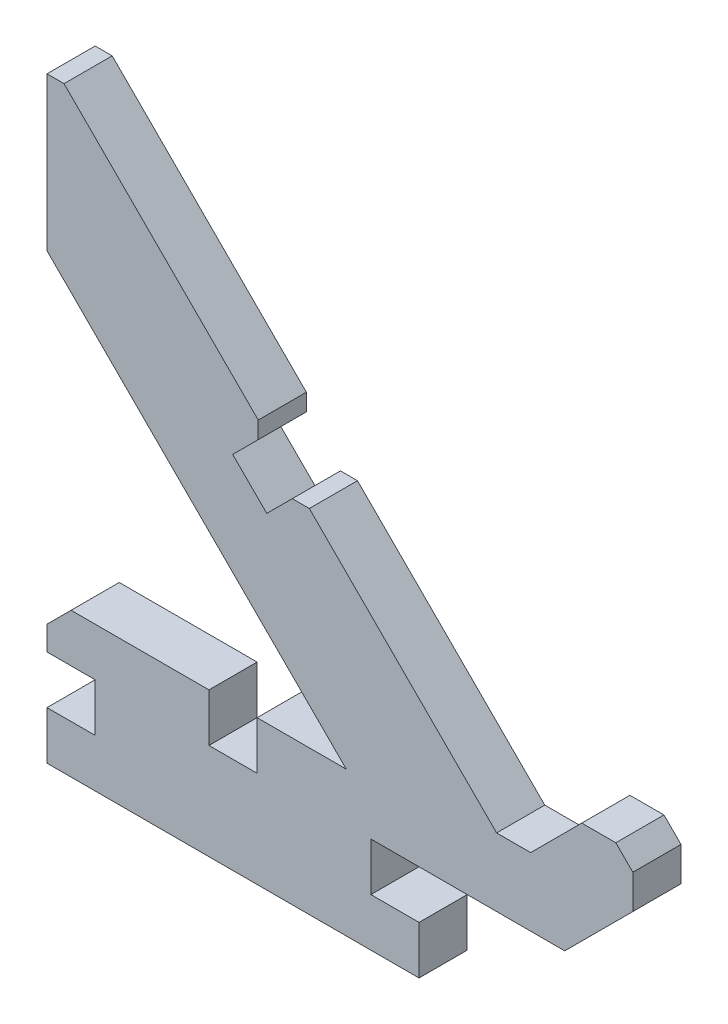
ISO-10303-21;
HEADER;
FILE_DESCRIPTION(('STEP AP214'),'2;1');
FILE_NAME('part.step','',(''),(''),'','','');
FILE_SCHEMA(('AUTOMOTIVE_DESIGN { 1 0 10303 214 1 1 1 1 }'));
ENDSEC;
DATA;
#1=APPLICATION_CONTEXT('core data for automotive mechanical design processes');
#2=APPLICATION_PROTOCOL_DEFINITION('international standard','automotive_design',2000,#1);
#3=PRODUCT_CONTEXT('',#1,'mechanical');
#4=PRODUCT('Part','Part','',(#3));
#5=PRODUCT_RELATED_PRODUCT_CATEGORY('part','',(#4));
#6=PRODUCT_DEFINITION_FORMATION('','',#4);
#7=PRODUCT_DEFINITION_CONTEXT('part definition',#1,'design');
#8=PRODUCT_DEFINITION('design','',#6,#7);
#9=PRODUCT_DEFINITION_SHAPE('','',#8);
#10=(LENGTH_UNIT() NAMED_UNIT(*) SI_UNIT(.MILLI.,.METRE.));
#11=(NAMED_UNIT(*) PLANE_ANGLE_UNIT() SI_UNIT($,.RADIAN.));
#12=(NAMED_UNIT(*) SI_UNIT($,.STERADIAN.) SOLID_ANGLE_UNIT());
#13=UNCERTAINTY_MEASURE_WITH_UNIT(LENGTH_MEASURE(1.E-05),#10,'distance_accuracy_value','');
#14=(GEOMETRIC_REPRESENTATION_CONTEXT(3) GLOBAL_UNCERTAINTY_ASSIGNED_CONTEXT((#13)) GLOBAL_UNIT_ASSIGNED_CONTEXT((#10,
#11,#12)) REPRESENTATION_CONTEXT('',''));
#15=CARTESIAN_POINT('',(0.,0.,0.));
#16=DIRECTION('',(0.,0.,1.));
#17=DIRECTION('',(1.,0.,0.));
#18=AXIS2_PLACEMENT_3D('',#15,#16,#17);
#19=CARTESIAN_POINT('',(0.,12.,4.));
#20=DIRECTION('',(0.,-1.,0.));
#21=DIRECTION('',(1.,0.,0.));
#22=AXIS2_PLACEMENT_3D('',#19,#20,#21);
#23=PLANE('',#22);
#24=DIRECTION('',(-1.,0.,0.));
#25=VECTOR('',#24,1.);
#26=CARTESIAN_POINT('',(0.,12.,0.));
#27=LINE('',#26,#25);
#28=CARTESIAN_POINT('',(24.8578643762687,12.,0.));
#29=VERTEX_POINT('',#28);
#30=CARTESIAN_POINT('',(17.45,12.,0.));
#31=VERTEX_POINT('',#30);
#32=EDGE_CURVE('E287',#29,#31,#27,.T.);
#33=ORIENTED_EDGE('',*,*,#32,.T.);
#34=DIRECTION('',(0.,0.,-1.));
#35=VECTOR('',#34,1.);
#36=CARTESIAN_POINT('',(17.45,12.,4.));
#37=LINE('',#36,#35);
#38=CARTESIAN_POINT('',(17.45,12.,4.));
#39=VERTEX_POINT('',#38);
#40=EDGE_CURVE('E264',#39,#31,#37,.T.);
#41=ORIENTED_EDGE('',*,*,#40,.F.);
#42=DIRECTION('',(-1.,0.,0.));
#43=VECTOR('',#42,1.);
#44=CARTESIAN_POINT('',(0.,12.,4.));
#45=LINE('',#44,#43);
#46=CARTESIAN_POINT('',(24.8578643762687,12.,4.));
#47=VERTEX_POINT('',#46);
#48=EDGE_CURVE('E271',#47,#39,#45,.T.);
#49=ORIENTED_EDGE('',*,*,#48,.F.);
#50=DIRECTION('',(0.,0.,-1.));
#51=VECTOR('',#50,1.);
#52=CARTESIAN_POINT('',(24.8578643762687,12.,4.));
#53=LINE('',#52,#51);
#54=EDGE_CURVE('E416',#47,#29,#53,.T.);
#55=ORIENTED_EDGE('',*,*,#54,.T.);
#56=EDGE_LOOP('',(#33,#41,#49,#55));
#57=FACE_BOUND('',#56,.T.);
#58=ADVANCED_FACE('F48',(#57),#23,.F.);
#59=CARTESIAN_POINT('',(17.45,0.,4.));
#60=DIRECTION('',(1.,0.,0.));
#61=DIRECTION('',(0.,0.,-1.));
#62=AXIS2_PLACEMENT_3D('',#59,#60,#61);
#63=PLANE('',#62);
#64=DIRECTION('',(0.,-1.,0.));
#65=VECTOR('',#64,1.);
#66=CARTESIAN_POINT('',(17.45,0.,0.));
#67=LINE('',#66,#65);
#68=CARTESIAN_POINT('',(17.45,8.,0.));
#69=VERTEX_POINT('',#68);
#70=EDGE_CURVE('E478',#31,#69,#67,.T.);
#71=ORIENTED_EDGE('',*,*,#70,.T.);
#72=DIRECTION('',(0.,0.,-1.));
#73=VECTOR('',#72,1.);
#74=CARTESIAN_POINT('',(17.45,8.,4.));
#75=LINE('',#74,#73);
#76=CARTESIAN_POINT('',(17.45,8.,4.));
#77=VERTEX_POINT('',#76);
#78=EDGE_CURVE('E266',#77,#69,#75,.T.);
#79=ORIENTED_EDGE('',*,*,#78,.F.);
#80=DIRECTION('',(0.,-1.,0.));
#81=VECTOR('',#80,1.);
#82=CARTESIAN_POINT('',(17.45,0.,4.));
#83=LINE('',#82,#81);
#84=EDGE_CURVE('E259',#39,#77,#83,.T.);
#85=ORIENTED_EDGE('',*,*,#84,.F.);
#86=ORIENTED_EDGE('',*,*,#40,.T.);
#87=EDGE_LOOP('',(#71,#79,#85,#86));
#88=FACE_BOUND('',#87,.T.);
#89=ADVANCED_FACE('F262',(#88),#63,.F.);
#90=CARTESIAN_POINT('',(0.,8.,4.));
#91=DIRECTION('',(0.,1.,0.));
#92=DIRECTION('',(0.,0.,1.));
#93=AXIS2_PLACEMENT_3D('',#90,#91,#92);
#94=PLANE('',#93);
#95=DIRECTION('',(1.,0.,0.));
#96=VECTOR('',#95,1.);
#97=CARTESIAN_POINT('',(0.,8.,0.));
#98=LINE('',#97,#96);
#99=CARTESIAN_POINT('',(13.45,8.,0.));
#100=VERTEX_POINT('',#99);
#101=EDGE_CURVE('E475',#100,#69,#98,.T.);
#102=ORIENTED_EDGE('',*,*,#101,.F.);
#103=DIRECTION('',(0.,0.,-1.));
#104=VECTOR('',#103,1.);
#105=CARTESIAN_POINT('',(13.45,8.,4.));
#106=LINE('',#105,#104);
#107=CARTESIAN_POINT('',(13.45,8.,4.));
#108=VERTEX_POINT('',#107);
#109=EDGE_CURVE('E298',#108,#100,#106,.T.);
#110=ORIENTED_EDGE('',*,*,#109,.F.);
#111=DIRECTION('',(1.,0.,0.));
#112=VECTOR('',#111,1.);
#113=CARTESIAN_POINT('',(0.,8.,4.));
#114=LINE('',#113,#112);
#115=EDGE_CURVE('E270',#108,#77,#114,.T.);
#116=ORIENTED_EDGE('',*,*,#115,.T.);
#117=ORIENTED_EDGE('',*,*,#78,.T.);
#118=EDGE_LOOP('',(#102,#110,#116,#117));
#119=FACE_BOUND('',#118,.T.);
#120=ADVANCED_FACE('F476',(#119),#94,.T.);
#121=CARTESIAN_POINT('',(13.45,0.,4.));
#122=DIRECTION('',(1.,0.,0.));
#123=DIRECTION('',(0.,0.,-1.));
#124=AXIS2_PLACEMENT_3D('',#121,#122,#123);
#125=PLANE('',#124);
#126=DIRECTION('',(0.,-1.,0.));
#127=VECTOR('',#126,1.);
#128=CARTESIAN_POINT('',(13.45,0.,0.));
#129=LINE('',#128,#127);
#130=CARTESIAN_POINT('',(13.45,12.,0.));
#131=VERTEX_POINT('',#130);
#132=EDGE_CURVE('E470',#131,#100,#129,.T.);
#133=ORIENTED_EDGE('',*,*,#132,.F.);
#134=DIRECTION('',(0.,0.,-1.));
#135=VECTOR('',#134,1.);
#136=CARTESIAN_POINT('',(13.45,12.,4.));
#137=LINE('',#136,#135);
#138=CARTESIAN_POINT('',(13.45,12.,4.));
#139=VERTEX_POINT('',#138);
#140=EDGE_CURVE('E459',#139,#131,#137,.T.);
#141=ORIENTED_EDGE('',*,*,#140,.F.);
#142=DIRECTION('',(0.,-1.,0.));
#143=VECTOR('',#142,1.);
#144=CARTESIAN_POINT('',(13.45,0.,4.));
#145=LINE('',#144,#143);
#146=EDGE_CURVE('E472',#139,#108,#145,.T.);
#147=ORIENTED_EDGE('',*,*,#146,.T.);
#148=ORIENTED_EDGE('',*,*,#109,.T.);
#149=EDGE_LOOP('',(#133,#141,#147,#148));
#150=FACE_BOUND('',#149,.T.);
#151=ADVANCED_FACE('F468',(#150),#125,.T.);
#152=CARTESIAN_POINT('',(2.00000000000001,12.,0.));
#153=VERTEX_POINT('',#152);
#154=EDGE_CURVE('E482',#131,#153,#27,.T.);
#155=ORIENTED_EDGE('',*,*,#154,.T.);
#156=DIRECTION('',(0.,0.,1.));
#157=VECTOR('',#156,1.);
#158=CARTESIAN_POINT('',(2.00000000000001,12.,4.));
#159=LINE('',#158,#157);
#160=CARTESIAN_POINT('',(2.00000000000001,12.,4.));
#161=VERTEX_POINT('',#160);
#162=EDGE_CURVE('E346',#153,#161,#159,.T.);
#163=ORIENTED_EDGE('',*,*,#162,.T.);
#164=EDGE_CURVE('E285',#139,#161,#45,.T.);
#165=ORIENTED_EDGE('',*,*,#164,.F.);
#166=ORIENTED_EDGE('',*,*,#140,.T.);
#167=EDGE_LOOP('',(#155,#163,#165,#166));
#168=FACE_BOUND('',#167,.T.);
#169=ADVANCED_FACE('F860',(#168),#23,.F.);
#170=CARTESIAN_POINT('',(0.,0.,4.));
#171=DIRECTION('',(-1.,0.,0.));
#172=DIRECTION('',(0.,0.,1.));
#173=AXIS2_PLACEMENT_3D('',#170,#171,#172);
#174=PLANE('',#173);
#175=DIRECTION('',(0.,1.,0.));
#176=VECTOR('',#175,1.);
#177=CARTESIAN_POINT('',(0.,0.,4.));
#178=LINE('',#177,#176);
#179=CARTESIAN_POINT('',(0.,8.,4.));
#180=VERTEX_POINT('',#179);
#181=CARTESIAN_POINT('',(0.,10.,4.));
#182=VERTEX_POINT('',#181);
#183=EDGE_CURVE('E608',#180,#182,#178,.T.);
#184=ORIENTED_EDGE('',*,*,#183,.T.);
#185=DIRECTION('',(0.,0.,-1.));
#186=VECTOR('',#185,1.);
#187=CARTESIAN_POINT('',(0.,10.,0.));
#188=LINE('',#187,#186);
#189=CARTESIAN_POINT('',(0.,10.,0.));
#190=VERTEX_POINT('',#189);
#191=EDGE_CURVE('E342',#182,#190,#188,.T.);
#192=ORIENTED_EDGE('',*,*,#191,.T.);
#193=DIRECTION('',(0.,1.,0.));
#194=VECTOR('',#193,1.);
#195=CARTESIAN_POINT('',(0.,0.,0.));
#196=LINE('',#195,#194);
#197=CARTESIAN_POINT('',(0.,8.,0.));
#198=VERTEX_POINT('',#197);
#199=EDGE_CURVE('E488',#198,#190,#196,.T.);
#200=ORIENTED_EDGE('',*,*,#199,.F.);
#201=DIRECTION('',(0.,0.,-1.));
#202=VECTOR('',#201,1.);
#203=CARTESIAN_POINT('',(0.,8.,4.));
#204=LINE('',#203,#202);
#205=EDGE_CURVE('E456',#180,#198,#204,.T.);
#206=ORIENTED_EDGE('',*,*,#205,.F.);
#207=EDGE_LOOP('',(#184,#192,#200,#206));
#208=FACE_BOUND('',#207,.T.);
#209=ADVANCED_FACE('F868',(#208),#174,.T.);
#210=CARTESIAN_POINT('',(0.,8.,4.));
#211=DIRECTION('',(0.,-1.,0.));
#212=DIRECTION('',(0.,0.,-1.));
#213=AXIS2_PLACEMENT_3D('',#210,#211,#212);
#214=PLANE('',#213);
#215=DIRECTION('',(-1.,0.,0.));
#216=VECTOR('',#215,1.);
#217=CARTESIAN_POINT('',(0.,8.,0.));
#218=LINE('',#217,#216);
#219=CARTESIAN_POINT('',(4.,8.,0.));
#220=VERTEX_POINT('',#219);
#221=EDGE_CURVE('E495',#220,#198,#218,.T.);
#222=ORIENTED_EDGE('',*,*,#221,.F.);
#223=DIRECTION('',(0.,0.,-1.));
#224=VECTOR('',#223,1.);
#225=CARTESIAN_POINT('',(4.,8.,4.));
#226=LINE('',#225,#224);
#227=CARTESIAN_POINT('',(4.,8.,4.));
#228=VERTEX_POINT('',#227);
#229=EDGE_CURVE('E453',#228,#220,#226,.T.);
#230=ORIENTED_EDGE('',*,*,#229,.F.);
#231=DIRECTION('',(-1.,0.,0.));
#232=VECTOR('',#231,1.);
#233=CARTESIAN_POINT('',(0.,8.,4.));
#234=LINE('',#233,#232);
#235=EDGE_CURVE('E616',#228,#180,#234,.T.);
#236=ORIENTED_EDGE('',*,*,#235,.T.);
#237=ORIENTED_EDGE('',*,*,#205,.T.);
#238=EDGE_LOOP('',(#222,#230,#236,#237));
#239=FACE_BOUND('',#238,.T.);
#240=ADVANCED_FACE('F874',(#239),#214,.T.);
#241=CARTESIAN_POINT('',(4.,0.,4.));
#242=DIRECTION('',(-1.,0.,0.));
#243=DIRECTION('',(0.,0.,1.));
#244=AXIS2_PLACEMENT_3D('',#241,#242,#243);
#245=PLANE('',#244);
#246=DIRECTION('',(0.,1.,0.));
#247=VECTOR('',#246,1.);
#248=CARTESIAN_POINT('',(4.,0.,0.));
#249=LINE('',#248,#247);
#250=CARTESIAN_POINT('',(4.,4.,0.));
#251=VERTEX_POINT('',#250);
#252=EDGE_CURVE('E499',#251,#220,#249,.T.);
#253=ORIENTED_EDGE('',*,*,#252,.F.);
#254=DIRECTION('',(0.,0.,-1.));
#255=VECTOR('',#254,1.);
#256=CARTESIAN_POINT('',(4.,4.,4.));
#257=LINE('',#256,#255);
#258=CARTESIAN_POINT('',(4.,4.,4.));
#259=VERTEX_POINT('',#258);
#260=EDGE_CURVE('E450',#259,#251,#257,.T.);
#261=ORIENTED_EDGE('',*,*,#260,.F.);
#262=DIRECTION('',(0.,1.,0.));
#263=VECTOR('',#262,1.);
#264=CARTESIAN_POINT('',(4.,0.,4.));
#265=LINE('',#264,#263);
#266=EDGE_CURVE('E623',#259,#228,#265,.T.);
#267=ORIENTED_EDGE('',*,*,#266,.T.);
#268=ORIENTED_EDGE('',*,*,#229,.T.);
#269=EDGE_LOOP('',(#253,#261,#267,#268));
#270=FACE_BOUND('',#269,.T.);
#271=ADVANCED_FACE('F884',(#270),#245,.T.);
#272=CARTESIAN_POINT('',(0.,4.,4.));
#273=DIRECTION('',(0.,1.,0.));
#274=DIRECTION('',(0.,0.,1.));
#275=AXIS2_PLACEMENT_3D('',#272,#273,#274);
#276=PLANE('',#275);
#277=DIRECTION('',(1.,0.,0.));
#278=VECTOR('',#277,1.);
#279=CARTESIAN_POINT('',(0.,4.,0.));
#280=LINE('',#279,#278);
#281=CARTESIAN_POINT('',(0.,4.,0.));
#282=VERTEX_POINT('',#281);
#283=EDGE_CURVE('E502',#282,#251,#280,.T.);
#284=ORIENTED_EDGE('',*,*,#283,.F.);
#285=DIRECTION('',(0.,0.,-1.));
#286=VECTOR('',#285,1.);
#287=CARTESIAN_POINT('',(0.,4.,4.));
#288=LINE('',#287,#286);
#289=CARTESIAN_POINT('',(0.,4.,4.));
#290=VERTEX_POINT('',#289);
#291=EDGE_CURVE('E447',#290,#282,#288,.T.);
#292=ORIENTED_EDGE('',*,*,#291,.F.);
#293=DIRECTION('',(1.,0.,0.));
#294=VECTOR('',#293,1.);
#295=CARTESIAN_POINT('',(0.,4.,4.));
#296=LINE('',#295,#294);
#297=EDGE_CURVE('E788',#290,#259,#296,.T.);
#298=ORIENTED_EDGE('',*,*,#297,.T.);
#299=ORIENTED_EDGE('',*,*,#260,.T.);
#300=EDGE_LOOP('',(#284,#292,#298,#299));
#301=FACE_BOUND('',#300,.T.);
#302=ADVANCED_FACE('F886',(#301),#276,.T.);
#303=CARTESIAN_POINT('',(0.,0.,4.));
#304=DIRECTION('',(-1.,0.,0.));
#305=DIRECTION('',(0.,0.,1.));
#306=AXIS2_PLACEMENT_3D('',#303,#304,#305);
#307=PLANE('',#306);
#308=DIRECTION('',(0.,1.,0.));
#309=VECTOR('',#308,1.);
#310=CARTESIAN_POINT('',(0.,0.,0.));
#311=LINE('',#310,#309);
#312=CARTESIAN_POINT('',(0.,0.,0.));
#313=VERTEX_POINT('',#312);
#314=EDGE_CURVE('E506',#313,#282,#311,.T.);
#315=ORIENTED_EDGE('',*,*,#314,.F.);
#316=DIRECTION('',(0.,0.,-1.));
#317=VECTOR('',#316,1.);
#318=CARTESIAN_POINT('',(0.,0.,4.));
#319=LINE('',#318,#317);
#320=CARTESIAN_POINT('',(0.,0.,4.));
#321=VERTEX_POINT('',#320);
#322=EDGE_CURVE('E444',#321,#313,#319,.T.);
#323=ORIENTED_EDGE('',*,*,#322,.F.);
#324=DIRECTION('',(0.,1.,0.));
#325=VECTOR('',#324,1.);
#326=CARTESIAN_POINT('',(0.,0.,4.));
#327=LINE('',#326,#325);
#328=EDGE_CURVE('E652',#321,#290,#327,.T.);
#329=ORIENTED_EDGE('',*,*,#328,.T.);
#330=ORIENTED_EDGE('',*,*,#291,.T.);
#331=EDGE_LOOP('',(#315,#323,#329,#330));
#332=FACE_BOUND('',#331,.T.);
#333=ADVANCED_FACE('F813',(#332),#307,.T.);
#334=CARTESIAN_POINT('',(0.,0.,4.));
#335=DIRECTION('',(0.,-1.,0.));
#336=DIRECTION('',(0.,0.,-1.));
#337=AXIS2_PLACEMENT_3D('',#334,#335,#336);
#338=PLANE('',#337);
#339=DIRECTION('',(-1.,0.,0.));
#340=VECTOR('',#339,1.);
#341=CARTESIAN_POINT('',(0.,0.,0.));
#342=LINE('',#341,#340);
#343=CARTESIAN_POINT('',(30.9,0.,0.));
#344=VERTEX_POINT('',#343);
#345=EDGE_CURVE('E510',#344,#313,#342,.T.);
#346=ORIENTED_EDGE('',*,*,#345,.F.);
#347=DIRECTION('',(0.,0.,-1.));
#348=VECTOR('',#347,1.);
#349=CARTESIAN_POINT('',(30.9,0.,4.));
#350=LINE('',#349,#348);
#351=CARTESIAN_POINT('',(30.9,0.,4.));
#352=VERTEX_POINT('',#351);
#353=EDGE_CURVE('E441',#352,#344,#350,.T.);
#354=ORIENTED_EDGE('',*,*,#353,.F.);
#355=DIRECTION('',(-1.,0.,0.));
#356=VECTOR('',#355,1.);
#357=CARTESIAN_POINT('',(0.,0.,4.));
#358=LINE('',#357,#356);
#359=EDGE_CURVE('E648',#352,#321,#358,.T.);
#360=ORIENTED_EDGE('',*,*,#359,.T.);
#361=ORIENTED_EDGE('',*,*,#322,.T.);
#362=EDGE_LOOP('',(#346,#354,#360,#361));
#363=FACE_BOUND('',#362,.T.);
#364=ADVANCED_FACE('F821',(#363),#338,.T.);
#365=CARTESIAN_POINT('',(30.9,0.,4.));
#366=DIRECTION('',(1.,0.,0.));
#367=DIRECTION('',(0.,0.,-1.));
#368=AXIS2_PLACEMENT_3D('',#365,#366,#367);
#369=PLANE('',#368);
#370=DIRECTION('',(0.,-1.,0.));
#371=VECTOR('',#370,1.);
#372=CARTESIAN_POINT('',(30.9,0.,0.));
#373=LINE('',#372,#371);
#374=CARTESIAN_POINT('',(30.9,4.,0.));
#375=VERTEX_POINT('',#374);
#376=EDGE_CURVE('E514',#375,#344,#373,.T.);
#377=ORIENTED_EDGE('',*,*,#376,.F.);
#378=DIRECTION('',(0.,0.,-1.));
#379=VECTOR('',#378,1.);
#380=CARTESIAN_POINT('',(30.9,4.,4.));
#381=LINE('',#380,#379);
#382=CARTESIAN_POINT('',(30.9,4.,4.));
#383=VERTEX_POINT('',#382);
#384=EDGE_CURVE('E438',#383,#375,#381,.T.);
#385=ORIENTED_EDGE('',*,*,#384,.F.);
#386=DIRECTION('',(0.,-1.,0.));
#387=VECTOR('',#386,1.);
#388=CARTESIAN_POINT('',(30.9,0.,4.));
#389=LINE('',#388,#387);
#390=EDGE_CURVE('E651',#383,#352,#389,.T.);
#391=ORIENTED_EDGE('',*,*,#390,.T.);
#392=ORIENTED_EDGE('',*,*,#353,.T.);
#393=EDGE_LOOP('',(#377,#385,#391,#392));
#394=FACE_BOUND('',#393,.T.);
#395=ADVANCED_FACE('F824',(#394),#369,.T.);
#396=CARTESIAN_POINT('',(0.,4.,4.));
#397=DIRECTION('',(0.,1.,0.));
#398=DIRECTION('',(0.,0.,1.));
#399=AXIS2_PLACEMENT_3D('',#396,#397,#398);
#400=PLANE('',#399);
#401=DIRECTION('',(1.,0.,0.));
#402=VECTOR('',#401,1.);
#403=CARTESIAN_POINT('',(0.,4.,0.));
#404=LINE('',#403,#402);
#405=CARTESIAN_POINT('',(26.9,4.,0.));
#406=VERTEX_POINT('',#405);
#407=EDGE_CURVE('E518',#406,#375,#404,.T.);
#408=ORIENTED_EDGE('',*,*,#407,.F.);
#409=DIRECTION('',(0.,0.,-1.));
#410=VECTOR('',#409,1.);
#411=CARTESIAN_POINT('',(26.9,4.,4.));
#412=LINE('',#411,#410);
#413=CARTESIAN_POINT('',(26.9,4.,4.));
#414=VERTEX_POINT('',#413);
#415=EDGE_CURVE('E435',#414,#406,#412,.T.);
#416=ORIENTED_EDGE('',*,*,#415,.F.);
#417=DIRECTION('',(1.,0.,0.));
#418=VECTOR('',#417,1.);
#419=CARTESIAN_POINT('',(0.,4.,4.));
#420=LINE('',#419,#418);
#421=EDGE_CURVE('E665',#414,#383,#420,.T.);
#422=ORIENTED_EDGE('',*,*,#421,.T.);
#423=ORIENTED_EDGE('',*,*,#384,.T.);
#424=EDGE_LOOP('',(#408,#416,#422,#423));
#425=FACE_BOUND('',#424,.T.);
#426=ADVANCED_FACE('F829',(#425),#400,.T.);
#427=CARTESIAN_POINT('',(26.9,0.,4.));
#428=DIRECTION('',(1.,0.,0.));
#429=DIRECTION('',(0.,0.,-1.));
#430=AXIS2_PLACEMENT_3D('',#427,#428,#429);
#431=PLANE('',#430);
#432=DIRECTION('',(0.,-1.,0.));
#433=VECTOR('',#432,1.);
#434=CARTESIAN_POINT('',(26.9,0.,0.));
#435=LINE('',#434,#433);
#436=CARTESIAN_POINT('',(26.9,8.,0.));
#437=VERTEX_POINT('',#436);
#438=EDGE_CURVE('E522',#437,#406,#435,.T.);
#439=ORIENTED_EDGE('',*,*,#438,.F.);
#440=DIRECTION('',(0.,0.,-1.));
#441=VECTOR('',#440,1.);
#442=CARTESIAN_POINT('',(26.9,8.,4.));
#443=LINE('',#442,#441);
#444=CARTESIAN_POINT('',(26.9,8.,4.));
#445=VERTEX_POINT('',#444);
#446=EDGE_CURVE('E432',#445,#437,#443,.T.);
#447=ORIENTED_EDGE('',*,*,#446,.F.);
#448=DIRECTION('',(0.,-1.,0.));
#449=VECTOR('',#448,1.);
#450=CARTESIAN_POINT('',(26.9,0.,4.));
#451=LINE('',#450,#449);
#452=EDGE_CURVE('E661',#445,#414,#451,.T.);
#453=ORIENTED_EDGE('',*,*,#452,.T.);
#454=ORIENTED_EDGE('',*,*,#415,.T.);
#455=EDGE_LOOP('',(#439,#447,#453,#454));
#456=FACE_BOUND('',#455,.T.);
#457=ADVANCED_FACE('F832',(#456),#431,.T.);
#458=CARTESIAN_POINT('',(0.,8.,4.));
#459=DIRECTION('',(0.,-1.,0.));
#460=DIRECTION('',(0.,0.,-1.));
#461=AXIS2_PLACEMENT_3D('',#458,#459,#460);
#462=PLANE('',#461);
#463=DIRECTION('',(-1.,0.,0.));
#464=VECTOR('',#463,1.);
#465=CARTESIAN_POINT('',(0.,8.,0.));
#466=LINE('',#465,#464);
#467=CARTESIAN_POINT('',(42.9999999999996,8.00000000000001,0.));
#468=VERTEX_POINT('',#467);
#469=EDGE_CURVE('E526',#468,#437,#466,.T.);
#470=ORIENTED_EDGE('',*,*,#469,.F.);
#471=DIRECTION('',(0.,0.,-1.));
#472=VECTOR('',#471,1.);
#473=CARTESIAN_POINT('',(42.9999999999996,8.00000000000001,4.));
#474=LINE('',#473,#472);
#475=CARTESIAN_POINT('',(42.9999999999996,8.00000000000001,4.));
#476=VERTEX_POINT('',#475);
#477=EDGE_CURVE('E429',#476,#468,#474,.T.);
#478=ORIENTED_EDGE('',*,*,#477,.F.);
#479=DIRECTION('',(-1.,0.,0.));
#480=VECTOR('',#479,1.);
#481=CARTESIAN_POINT('',(0.,8.,4.));
#482=LINE('',#481,#480);
#483=EDGE_CURVE('E664',#476,#445,#482,.T.);
#484=ORIENTED_EDGE('',*,*,#483,.T.);
#485=ORIENTED_EDGE('',*,*,#446,.T.);
#486=EDGE_LOOP('',(#470,#478,#484,#485));
#487=FACE_BOUND('',#486,.T.);
#488=ADVANCED_FACE('F888',(#487),#462,.T.);
#489=CARTESIAN_POINT('',(17.4999999999995,-17.4999999999997,4.));
#490=DIRECTION('',(-0.707106781186543,0.707106781186552,0.));
#491=DIRECTION('',(-0.707106781186552,-0.707106781186543,0.));
#492=AXIS2_PLACEMENT_3D('',#489,#490,#491);
#493=PLANE('',#492);
#494=DIRECTION('',(0.707106781186552,0.707106781186543,0.));
#495=VECTOR('',#494,1.);
#496=CARTESIAN_POINT('',(17.4999999999995,-17.4999999999997,0.));
#497=LINE('',#496,#495);
#498=CARTESIAN_POINT('',(48.656854249492,13.6568542494923,0.));
#499=VERTEX_POINT('',#498);
#500=EDGE_CURVE('E530',#468,#499,#497,.T.);
#501=ORIENTED_EDGE('',*,*,#500,.T.);
#502=DIRECTION('',(0.,0.,1.));
#503=VECTOR('',#502,1.);
#504=CARTESIAN_POINT('',(48.656854249492,13.6568542494923,4.));
#505=LINE('',#504,#503);
#506=CARTESIAN_POINT('',(48.656854249492,13.6568542494923,4.));
#507=VERTEX_POINT('',#506);
#508=EDGE_CURVE('E316',#499,#507,#505,.T.);
#509=ORIENTED_EDGE('',*,*,#508,.T.);
#510=DIRECTION('',(0.707106781186552,0.707106781186543,0.));
#511=VECTOR('',#510,1.);
#512=CARTESIAN_POINT('',(17.4999999999995,-17.4999999999997,4.));
#513=LINE('',#512,#511);
#514=EDGE_CURVE('E564',#476,#507,#513,.T.);
#515=ORIENTED_EDGE('',*,*,#514,.F.);
#516=ORIENTED_EDGE('',*,*,#477,.T.);
#517=EDGE_LOOP('',(#501,#509,#515,#516));
#518=FACE_BOUND('',#517,.T.);
#519=ADVANCED_FACE('F889',(#518),#493,.F.);
#520=CARTESIAN_POINT('',(32.5710678118655,32.5710678118652,4.));
#521=DIRECTION('',(-0.707106781186551,-0.707106781186544,0.));
#522=DIRECTION('',(0.707106781186544,-0.707106781186551,0.));
#523=AXIS2_PLACEMENT_3D('',#520,#521,#522);
#524=PLANE('',#523);
#525=DIRECTION('',(-0.707106781186544,0.707106781186551,0.));
#526=VECTOR('',#525,1.);
#527=CARTESIAN_POINT('',(32.5710678118655,32.5710678118652,4.));
#528=LINE('',#527,#526);
#529=CARTESIAN_POINT('',(48.656854249492,16.4852813742385,4.));
#530=VERTEX_POINT('',#529);
#531=CARTESIAN_POINT('',(47.2426406871189,17.8994949366116,4.));
#532=VERTEX_POINT('',#531);
#533=EDGE_CURVE('E557',#530,#532,#528,.T.);
#534=ORIENTED_EDGE('',*,*,#533,.F.);
#535=DIRECTION('',(0.,0.,-1.));
#536=VECTOR('',#535,1.);
#537=CARTESIAN_POINT('',(48.656854249492,16.4852813742385,4.));
#538=LINE('',#537,#536);
#539=CARTESIAN_POINT('',(48.656854249492,16.4852813742385,0.));
#540=VERTEX_POINT('',#539);
#541=EDGE_CURVE('E295',#530,#540,#538,.T.);
#542=ORIENTED_EDGE('',*,*,#541,.T.);
#543=DIRECTION('',(-0.707106781186544,0.707106781186551,0.));
#544=VECTOR('',#543,1.);
#545=CARTESIAN_POINT('',(32.5710678118655,32.5710678118652,0.));
#546=LINE('',#545,#544);
#547=CARTESIAN_POINT('',(47.2426406871189,17.8994949366116,0.));
#548=VERTEX_POINT('',#547);
#549=EDGE_CURVE('E534',#540,#548,#546,.T.);
#550=ORIENTED_EDGE('',*,*,#549,.T.);
#551=DIRECTION('',(0.,0.,1.));
#552=VECTOR('',#551,1.);
#553=CARTESIAN_POINT('',(47.2426406871189,17.8994949366116,4.));
#554=LINE('',#553,#552);
#555=EDGE_CURVE('E289',#548,#532,#554,.T.);
#556=ORIENTED_EDGE('',*,*,#555,.T.);
#557=EDGE_LOOP('',(#534,#542,#550,#556));
#558=FACE_BOUND('',#557,.T.);
#559=ADVANCED_FACE('F843',(#558),#524,.F.);
#560=CARTESIAN_POINT('',(13.2573593128803,-13.2573593128804,4.));
#561=DIRECTION('',(0.707106781186544,-0.707106781186551,0.));
#562=DIRECTION('',(0.707106781186551,0.707106781186544,0.));
#563=AXIS2_PLACEMENT_3D('',#560,#561,#562);
#564=PLANE('',#563);
#565=DIRECTION('',(-0.707106781186551,-0.707106781186544,0.));
#566=VECTOR('',#565,1.);
#567=CARTESIAN_POINT('',(13.2573593128803,-13.2573593128804,4.));
#568=LINE('',#567,#566);
#569=CARTESIAN_POINT('',(44.4142135623727,17.8994949366117,4.));
#570=VERTEX_POINT('',#569);
#571=CARTESIAN_POINT('',(40.1715728752534,13.6568542494924,4.));
#572=VERTEX_POINT('',#571);
#573=EDGE_CURVE('E553',#570,#572,#568,.T.);
#574=ORIENTED_EDGE('',*,*,#573,.F.);
#575=DIRECTION('',(0.,0.,-1.));
#576=VECTOR('',#575,1.);
#577=CARTESIAN_POINT('',(44.4142135623727,17.8994949366117,4.));
#578=LINE('',#577,#576);
#579=CARTESIAN_POINT('',(44.4142135623727,17.8994949366117,0.));
#580=VERTEX_POINT('',#579);
#581=EDGE_CURVE('E334',#570,#580,#578,.T.);
#582=ORIENTED_EDGE('',*,*,#581,.T.);
#583=DIRECTION('',(-0.707106781186551,-0.707106781186544,0.));
#584=VECTOR('',#583,1.);
#585=CARTESIAN_POINT('',(13.2573593128803,-13.2573593128804,0.));
#586=LINE('',#585,#584);
#587=CARTESIAN_POINT('',(40.1715728752534,13.6568542494924,0.));
#588=VERTEX_POINT('',#587);
#589=EDGE_CURVE('E406',#580,#588,#586,.T.);
#590=ORIENTED_EDGE('',*,*,#589,.T.);
#591=DIRECTION('',(0.,0.,1.));
#592=VECTOR('',#591,1.);
#593=CARTESIAN_POINT('',(40.1715728752534,13.6568542494924,4.));
#594=LINE('',#593,#592);
#595=EDGE_CURVE('E331',#588,#572,#594,.T.);
#596=ORIENTED_EDGE('',*,*,#595,.T.);
#597=EDGE_LOOP('',(#574,#582,#590,#596));
#598=FACE_BOUND('',#597,.T.);
#599=ADVANCED_FACE('F544',(#598),#564,.F.);
#600=CARTESIAN_POINT('',(25.5,25.4999999999997,4.));
#601=DIRECTION('',(0.707106781186551,0.707106781186544,0.));
#602=DIRECTION('',(-0.707106781186544,0.707106781186551,0.));
#603=AXIS2_PLACEMENT_3D('',#600,#601,#602);
#604=PLANE('',#603);
#605=DIRECTION('',(0.707106781186544,-0.707106781186551,0.));
#606=VECTOR('',#605,1.);
#607=CARTESIAN_POINT('',(25.5,25.4999999999997,0.));
#608=LINE('',#607,#606);
#609=CARTESIAN_POINT('',(21.7867965644032,29.2132034355965,0.));
#610=VERTEX_POINT('',#609);
#611=CARTESIAN_POINT('',(37.3431457505072,13.6568542494924,0.));
#612=VERTEX_POINT('',#611);
#613=EDGE_CURVE('E399',#610,#612,#608,.T.);
#614=ORIENTED_EDGE('',*,*,#613,.F.);
#615=DIRECTION('',(0.,0.,1.));
#616=VECTOR('',#615,1.);
#617=CARTESIAN_POINT('',(21.7867965644032,29.2132034355965,4.));
#618=LINE('',#617,#616);
#619=CARTESIAN_POINT('',(21.7867965644032,29.2132034355965,4.));
#620=VERTEX_POINT('',#619);
#621=EDGE_CURVE('E11',#610,#620,#618,.T.);
#622=ORIENTED_EDGE('',*,*,#621,.T.);
#623=DIRECTION('',(0.707106781186544,-0.707106781186551,0.));
#624=VECTOR('',#623,1.);
#625=CARTESIAN_POINT('',(25.5,25.4999999999997,4.));
#626=LINE('',#625,#624);
#627=CARTESIAN_POINT('',(37.3431457505072,13.6568542494924,4.));
#628=VERTEX_POINT('',#627);
#629=EDGE_CURVE('E552',#620,#628,#626,.T.);
#630=ORIENTED_EDGE('',*,*,#629,.T.);
#631=DIRECTION('',(0.,0.,-1.));
#632=VECTOR('',#631,1.);
#633=CARTESIAN_POINT('',(37.3431457505072,13.6568542494924,4.));
#634=LINE('',#633,#632);
#635=EDGE_CURVE('E338',#628,#612,#634,.T.);
#636=ORIENTED_EDGE('',*,*,#635,.T.);
#637=EDGE_LOOP('',(#614,#622,#630,#636));
#638=FACE_BOUND('',#637,.T.);
#639=ADVANCED_FACE('F957',(#638),#604,.T.);
#640=CARTESIAN_POINT('',(-4.42031021678367,4.42031021678386,4.));
#641=DIRECTION('',(-0.707106781186532,0.707106781186563,0.));
#642=DIRECTION('',(-0.707106781186563,-0.707106781186532,0.));
#643=AXIS2_PLACEMENT_3D('',#640,#641,#642);
#644=PLANE('',#643);
#645=DIRECTION('',(0.707106781186563,0.707106781186532,0.));
#646=VECTOR('',#645,1.);
#647=CARTESIAN_POINT('',(-4.42031021678367,4.42031021678386,4.));
#648=LINE('',#647,#646);
#649=CARTESIAN_POINT('',(18.2512626584704,27.091883092037,4.));
#650=VERTEX_POINT('',#649);
#651=CARTESIAN_POINT('',(20.3725830020301,29.2132034355966,4.));
#652=VERTEX_POINT('',#651);
#653=EDGE_CURVE('E391',#650,#652,#648,.T.);
#654=ORIENTED_EDGE('',*,*,#653,.T.);
#655=DIRECTION('',(0.,0.,-1.));
#656=VECTOR('',#655,1.);
#657=CARTESIAN_POINT('',(20.3725830020301,29.2132034355966,4.));
#658=LINE('',#657,#656);
#659=CARTESIAN_POINT('',(20.3725830020301,29.2132034355966,0.));
#660=VERTEX_POINT('',#659);
#661=EDGE_CURVE('E58',#652,#660,#658,.T.);
#662=ORIENTED_EDGE('',*,*,#661,.T.);
#663=DIRECTION('',(0.707106781186563,0.707106781186532,0.));
#664=VECTOR('',#663,1.);
#665=CARTESIAN_POINT('',(-4.42031021678367,4.42031021678386,0.));
#666=LINE('',#665,#664);
#667=CARTESIAN_POINT('',(18.2512626584704,27.091883092037,0.));
#668=VERTEX_POINT('',#667);
#669=EDGE_CURVE('E389',#668,#660,#666,.T.);
#670=ORIENTED_EDGE('',*,*,#669,.F.);
#671=DIRECTION('',(0.,0.,-1.));
#672=VECTOR('',#671,1.);
#673=CARTESIAN_POINT('',(18.2512626584704,27.091883092037,4.));
#674=LINE('',#673,#672);
#675=EDGE_CURVE('E426',#650,#668,#674,.T.);
#676=ORIENTED_EDGE('',*,*,#675,.F.);
#677=EDGE_LOOP('',(#654,#662,#670,#676));
#678=FACE_BOUND('',#677,.T.);
#679=ADVANCED_FACE('F388',(#678),#644,.T.);
#680=CARTESIAN_POINT('',(22.6715728752541,22.6715728752531,4.));
#681=DIRECTION('',(0.707106781186564,0.707106781186531,0.));
#682=DIRECTION('',(-0.707106781186531,0.707106781186564,0.));
#683=AXIS2_PLACEMENT_3D('',#680,#681,#682);
#684=PLANE('',#683);
#685=DIRECTION('',(0.707106781186531,-0.707106781186564,0.));
#686=VECTOR('',#685,1.);
#687=CARTESIAN_POINT('',(22.6715728752541,22.6715728752531,0.));
#688=LINE('',#687,#686);
#689=CARTESIAN_POINT('',(15.4228355337243,29.9203102167832,0.));
#690=VERTEX_POINT('',#689);
#691=EDGE_CURVE('E397',#690,#668,#688,.T.);
#692=ORIENTED_EDGE('',*,*,#691,.F.);
#693=DIRECTION('',(0.,0.,-1.));
#694=VECTOR('',#693,1.);
#695=CARTESIAN_POINT('',(15.4228355337243,29.9203102167832,4.));
#696=LINE('',#695,#694);
#697=CARTESIAN_POINT('',(15.4228355337243,29.9203102167832,4.));
#698=VERTEX_POINT('',#697);
#699=EDGE_CURVE('E422',#698,#690,#696,.T.);
#700=ORIENTED_EDGE('',*,*,#699,.F.);
#701=DIRECTION('',(0.707106781186531,-0.707106781186564,0.));
#702=VECTOR('',#701,1.);
#703=CARTESIAN_POINT('',(22.6715728752541,22.6715728752531,4.));
#704=LINE('',#703,#702);
#705=EDGE_CURVE('E570',#698,#650,#704,.T.);
#706=ORIENTED_EDGE('',*,*,#705,.T.);
#707=ORIENTED_EDGE('',*,*,#675,.T.);
#708=EDGE_LOOP('',(#692,#700,#706,#707));
#709=FACE_BOUND('',#708,.T.);
#710=ADVANCED_FACE('F971',(#709),#684,.T.);
#711=CARTESIAN_POINT('',(-7.24873734152979,7.2487373415301,4.));
#712=DIRECTION('',(0.707106781186532,-0.707106781186563,0.));
#713=DIRECTION('',(0.707106781186563,0.707106781186532,0.));
#714=AXIS2_PLACEMENT_3D('',#711,#712,#713);
#715=PLANE('',#714);
#716=DIRECTION('',(-0.707106781186563,-0.707106781186532,0.));
#717=VECTOR('',#716,1.);
#718=CARTESIAN_POINT('',(-7.24873734152979,7.2487373415301,0.));
#719=LINE('',#718,#717);
#720=CARTESIAN_POINT('',(17.5441558772839,32.0416305603428,0.));
#721=VERTEX_POINT('',#720);
#722=EDGE_CURVE('E403',#721,#690,#719,.T.);
#723=ORIENTED_EDGE('',*,*,#722,.F.);
#724=DIRECTION('',(0.,0.,1.));
#725=VECTOR('',#724,1.);
#726=CARTESIAN_POINT('',(17.5441558772839,32.0416305603428,4.));
#727=LINE('',#726,#725);
#728=CARTESIAN_POINT('',(17.5441558772839,32.0416305603428,4.));
#729=VERTEX_POINT('',#728);
#730=EDGE_CURVE('E373',#721,#729,#727,.T.);
#731=ORIENTED_EDGE('',*,*,#730,.T.);
#732=DIRECTION('',(-0.707106781186563,-0.707106781186532,0.));
#733=VECTOR('',#732,1.);
#734=CARTESIAN_POINT('',(-7.24873734152979,7.2487373415301,4.));
#735=LINE('',#734,#733);
#736=EDGE_CURVE('E574',#729,#698,#735,.T.);
#737=ORIENTED_EDGE('',*,*,#736,.T.);
#738=ORIENTED_EDGE('',*,*,#699,.T.);
#739=EDGE_LOOP('',(#723,#731,#737,#738));
#740=FACE_BOUND('',#739,.T.);
#741=ADVANCED_FACE('F979',(#740),#715,.T.);
#742=CARTESIAN_POINT('',(1.41421356237311,49.5857864376269,4.));
#743=VERTEX_POINT('',#742);
#744=CARTESIAN_POINT('',(17.544155877284,33.4558441227159,4.));
#745=VERTEX_POINT('',#744);
#746=EDGE_CURVE('E562',#743,#745,#626,.T.);
#747=ORIENTED_EDGE('',*,*,#746,.T.);
#748=DIRECTION('',(0.,0.,-1.));
#749=VECTOR('',#748,1.);
#750=CARTESIAN_POINT('',(17.544155877284,33.4558441227159,4.));
#751=LINE('',#750,#749);
#752=CARTESIAN_POINT('',(17.544155877284,33.4558441227159,0.));
#753=VERTEX_POINT('',#752);
#754=EDGE_CURVE('E363',#745,#753,#751,.T.);
#755=ORIENTED_EDGE('',*,*,#754,.T.);
#756=CARTESIAN_POINT('',(1.41421356237311,49.5857864376269,0.));
#757=VERTEX_POINT('',#756);
#758=EDGE_CURVE('E408',#757,#753,#608,.T.);
#759=ORIENTED_EDGE('',*,*,#758,.F.);
#760=DIRECTION('',(0.,0.,1.));
#761=VECTOR('',#760,1.);
#762=CARTESIAN_POINT('',(1.41421356237311,49.5857864376269,4.));
#763=LINE('',#762,#761);
#764=EDGE_CURVE('E353',#757,#743,#763,.T.);
#765=ORIENTED_EDGE('',*,*,#764,.T.);
#766=EDGE_LOOP('',(#747,#755,#759,#765));
#767=FACE_BOUND('',#766,.T.);
#768=ADVANCED_FACE('F600',(#767),#604,.T.);
#769=CARTESIAN_POINT('',(0.,36.857864376269,4.));
#770=VERTEX_POINT('',#769);
#771=CARTESIAN_POINT('',(0.,49.5857864376269,4.));
#772=VERTEX_POINT('',#771);
#773=EDGE_CURVE('E578',#770,#772,#178,.T.);
#774=ORIENTED_EDGE('',*,*,#773,.T.);
#775=DIRECTION('',(0.,0.,-1.));
#776=VECTOR('',#775,1.);
#777=CARTESIAN_POINT('',(0.,49.5857864376269,4.));
#778=LINE('',#777,#776);
#779=CARTESIAN_POINT('',(0.,49.5857864376269,0.));
#780=VERTEX_POINT('',#779);
#781=EDGE_CURVE('E349',#772,#780,#778,.T.);
#782=ORIENTED_EDGE('',*,*,#781,.T.);
#783=CARTESIAN_POINT('',(0.,36.857864376269,0.));
#784=VERTEX_POINT('',#783);
#785=EDGE_CURVE('E415',#784,#780,#196,.T.);
#786=ORIENTED_EDGE('',*,*,#785,.F.);
#787=DIRECTION('',(0.,0.,-1.));
#788=VECTOR('',#787,1.);
#789=CARTESIAN_POINT('',(0.,36.857864376269,4.));
#790=LINE('',#789,#788);
#791=EDGE_CURVE('E419',#770,#784,#790,.T.);
#792=ORIENTED_EDGE('',*,*,#791,.F.);
#793=EDGE_LOOP('',(#774,#782,#786,#792));
#794=FACE_BOUND('',#793,.T.);
#795=ADVANCED_FACE('F588',(#794),#174,.T.);
#796=CARTESIAN_POINT('',(18.4289321881345,18.4289321881343,4.));
#797=DIRECTION('',(0.707106781186551,0.707106781186544,0.));
#798=DIRECTION('',(-0.707106781186544,0.707106781186551,0.));
#799=AXIS2_PLACEMENT_3D('',#796,#797,#798);
#800=PLANE('',#799);
#801=DIRECTION('',(0.707106781186544,-0.707106781186551,0.));
#802=VECTOR('',#801,1.);
#803=CARTESIAN_POINT('',(18.4289321881345,18.4289321881343,0.));
#804=LINE('',#803,#802);
#805=EDGE_CURVE('E283',#784,#29,#804,.T.);
#806=ORIENTED_EDGE('',*,*,#805,.T.);
#807=ORIENTED_EDGE('',*,*,#54,.F.);
#808=DIRECTION('',(0.707106781186544,-0.707106781186551,0.));
#809=VECTOR('',#808,1.);
#810=CARTESIAN_POINT('',(18.4289321881345,18.4289321881343,4.));
#811=LINE('',#810,#809);
#812=EDGE_CURVE('E278',#770,#47,#811,.T.);
#813=ORIENTED_EDGE('',*,*,#812,.F.);
#814=ORIENTED_EDGE('',*,*,#791,.T.);
#815=EDGE_LOOP('',(#806,#807,#813,#814));
#816=FACE_BOUND('',#815,.T.);
#817=ADVANCED_FACE('F1002',(#816),#800,.F.);
#818=CARTESIAN_POINT('',(0.,0.,4.));
#819=DIRECTION('',(0.,0.,1.));
#820=DIRECTION('',(1.,0.,0.));
#821=AXIS2_PLACEMENT_3D('',#818,#819,#820);
#822=PLANE('',#821);
#823=ORIENTED_EDGE('',*,*,#736,.F.);
#824=DIRECTION('',(0.,-1.,0.));
#825=VECTOR('',#824,1.);
#826=CARTESIAN_POINT('',(17.5441558772832,-4.30405419326485E-13,4.));
#827=LINE('',#826,#825);
#828=EDGE_CURVE('E378',#729,#745,#827,.F.);
#829=ORIENTED_EDGE('',*,*,#828,.T.);
#830=ORIENTED_EDGE('',*,*,#746,.F.);
#831=DIRECTION('',(1.,0.,0.));
#832=VECTOR('',#831,1.);
#833=CARTESIAN_POINT('',(0.,49.5857864376269,4.));
#834=LINE('',#833,#832);
#835=EDGE_CURVE('E319',#743,#772,#834,.F.);
#836=ORIENTED_EDGE('',*,*,#835,.T.);
#837=ORIENTED_EDGE('',*,*,#773,.F.);
#838=ORIENTED_EDGE('',*,*,#812,.T.);
#839=ORIENTED_EDGE('',*,*,#48,.T.);
#840=ORIENTED_EDGE('',*,*,#84,.T.);
#841=ORIENTED_EDGE('',*,*,#115,.F.);
#842=ORIENTED_EDGE('',*,*,#146,.F.);
#843=ORIENTED_EDGE('',*,*,#164,.T.);
#844=DIRECTION('',(-0.707106781186549,-0.707106781186546,0.));
#845=VECTOR('',#844,1.);
#846=CARTESIAN_POINT('',(-5.,5.00000000000002,4.));
#847=LINE('',#846,#845);
#848=EDGE_CURVE('E322',#161,#182,#847,.T.);
#849=ORIENTED_EDGE('',*,*,#848,.T.);
#850=ORIENTED_EDGE('',*,*,#183,.F.);
#851=ORIENTED_EDGE('',*,*,#235,.F.);
#852=ORIENTED_EDGE('',*,*,#266,.F.);
#853=ORIENTED_EDGE('',*,*,#297,.F.);
#854=ORIENTED_EDGE('',*,*,#328,.F.);
#855=ORIENTED_EDGE('',*,*,#359,.F.);
#856=ORIENTED_EDGE('',*,*,#390,.F.);
#857=ORIENTED_EDGE('',*,*,#421,.F.);
#858=ORIENTED_EDGE('',*,*,#452,.F.);
#859=ORIENTED_EDGE('',*,*,#483,.F.);
#860=ORIENTED_EDGE('',*,*,#514,.T.);
#861=DIRECTION('',(0.,-1.,0.));
#862=VECTOR('',#861,1.);
#863=CARTESIAN_POINT('',(48.6568542494919,-3.58105124626887E-13,4.));
#864=LINE('',#863,#862);
#865=EDGE_CURVE('E328',#507,#530,#864,.F.);
#866=ORIENTED_EDGE('',*,*,#865,.T.);
#867=ORIENTED_EDGE('',*,*,#533,.T.);
#868=DIRECTION('',(1.,0.,0.));
#869=VECTOR('',#868,1.);
#870=CARTESIAN_POINT('',(1.75649137588892E-13,17.8994949366121,4.));
#871=LINE('',#870,#869);
#872=EDGE_CURVE('E325',#532,#570,#871,.F.);
#873=ORIENTED_EDGE('',*,*,#872,.T.);
#874=ORIENTED_EDGE('',*,*,#573,.T.);
#875=DIRECTION('',(-1.,0.,0.));
#876=VECTOR('',#875,1.);
#877=CARTESIAN_POINT('',(37.3431457505072,13.6568542494924,4.));
#878=LINE('',#877,#876);
#879=EDGE_CURVE('E359',#572,#628,#878,.T.);
#880=ORIENTED_EDGE('',*,*,#879,.T.);
#881=ORIENTED_EDGE('',*,*,#629,.F.);
#882=DIRECTION('',(1.,0.,0.));
#883=VECTOR('',#882,1.);
#884=CARTESIAN_POINT('',(2.86671440051404E-13,29.2132034355968,4.));
#885=LINE('',#884,#883);
#886=EDGE_CURVE('E65',#620,#652,#885,.F.);
#887=ORIENTED_EDGE('',*,*,#886,.T.);
#888=ORIENTED_EDGE('',*,*,#653,.F.);
#889=ORIENTED_EDGE('',*,*,#705,.F.);
#890=EDGE_LOOP('',(#823,#829,#830,#836,#837,#838,#839,#840,#841,#842,#843,#849,#850,#851,#852,
#853,#854,#855,#856,#857,#858,#859,#860,#866,#867,#873,#874,#880,#881,#887,#888,#889));
#891=FACE_BOUND('',#890,.T.);
#892=ADVANCED_FACE('F275',(#891),#822,.T.);
#893=CARTESIAN_POINT('',(0.,0.,0.));
#894=DIRECTION('',(0.,0.,1.));
#895=DIRECTION('',(1.,0.,0.));
#896=AXIS2_PLACEMENT_3D('',#893,#894,#895);
#897=PLANE('',#896);
#898=ORIENTED_EDGE('',*,*,#758,.T.);
#899=DIRECTION('',(0.,1.,0.));
#900=VECTOR('',#899,1.);
#901=CARTESIAN_POINT('',(17.544155877284,33.4558441227159,0.));
#902=LINE('',#901,#900);
#903=EDGE_CURVE('E370',#753,#721,#902,.F.);
#904=ORIENTED_EDGE('',*,*,#903,.T.);
#905=ORIENTED_EDGE('',*,*,#722,.T.);
#906=ORIENTED_EDGE('',*,*,#691,.T.);
#907=ORIENTED_EDGE('',*,*,#669,.T.);
#908=DIRECTION('',(-1.,0.,0.));
#909=VECTOR('',#908,1.);
#910=CARTESIAN_POINT('',(20.3725830020301,29.2132034355966,0.));
#911=LINE('',#910,#909);
#912=EDGE_CURVE('E367',#660,#610,#911,.F.);
#913=ORIENTED_EDGE('',*,*,#912,.T.);
#914=ORIENTED_EDGE('',*,*,#613,.T.);
#915=DIRECTION('',(1.,0.,0.));
#916=VECTOR('',#915,1.);
#917=CARTESIAN_POINT('',(0.,13.6568542494926,0.));
#918=LINE('',#917,#916);
#919=EDGE_CURVE('E356',#612,#588,#918,.T.);
#920=ORIENTED_EDGE('',*,*,#919,.T.);
#921=ORIENTED_EDGE('',*,*,#589,.F.);
#922=DIRECTION('',(-1.,0.,0.));
#923=VECTOR('',#922,1.);
#924=CARTESIAN_POINT('',(44.4142135623727,17.8994949366117,0.));
#925=LINE('',#924,#923);
#926=EDGE_CURVE('E310',#580,#548,#925,.F.);
#927=ORIENTED_EDGE('',*,*,#926,.T.);
#928=ORIENTED_EDGE('',*,*,#549,.F.);
#929=DIRECTION('',(0.,1.,0.));
#930=VECTOR('',#929,1.);
#931=CARTESIAN_POINT('',(48.656854249492,16.4852813742385,0.));
#932=LINE('',#931,#930);
#933=EDGE_CURVE('E313',#540,#499,#932,.F.);
#934=ORIENTED_EDGE('',*,*,#933,.T.);
#935=ORIENTED_EDGE('',*,*,#500,.F.);
#936=ORIENTED_EDGE('',*,*,#469,.T.);
#937=ORIENTED_EDGE('',*,*,#438,.T.);
#938=ORIENTED_EDGE('',*,*,#407,.T.);
#939=ORIENTED_EDGE('',*,*,#376,.T.);
#940=ORIENTED_EDGE('',*,*,#345,.T.);
#941=ORIENTED_EDGE('',*,*,#314,.T.);
#942=ORIENTED_EDGE('',*,*,#283,.T.);
#943=ORIENTED_EDGE('',*,*,#252,.T.);
#944=ORIENTED_EDGE('',*,*,#221,.T.);
#945=ORIENTED_EDGE('',*,*,#199,.T.);
#946=DIRECTION('',(0.707106781186549,0.707106781186546,0.));
#947=VECTOR('',#946,1.);
#948=CARTESIAN_POINT('',(0.,10.,0.));
#949=LINE('',#948,#947);
#950=EDGE_CURVE('E307',#190,#153,#949,.T.);
#951=ORIENTED_EDGE('',*,*,#950,.T.);
#952=ORIENTED_EDGE('',*,*,#154,.F.);
#953=ORIENTED_EDGE('',*,*,#132,.T.);
#954=ORIENTED_EDGE('',*,*,#101,.T.);
#955=ORIENTED_EDGE('',*,*,#70,.F.);
#956=ORIENTED_EDGE('',*,*,#32,.F.);
#957=ORIENTED_EDGE('',*,*,#805,.F.);
#958=ORIENTED_EDGE('',*,*,#785,.T.);
#959=DIRECTION('',(-1.,0.,0.));
#960=VECTOR('',#959,1.);
#961=CARTESIAN_POINT('',(0.,49.5857864376269,0.));
#962=LINE('',#961,#960);
#963=EDGE_CURVE('E305',#780,#757,#962,.F.);
#964=ORIENTED_EDGE('',*,*,#963,.T.);
#965=EDGE_LOOP('',(#898,#904,#905,#906,#907,#913,#914,#920,#921,#927,#928,#934,#935,#936,#937,
#938,#939,#940,#941,#942,#943,#944,#945,#951,#952,#953,#954,#955,#956,#957,#958,#964));
#966=FACE_BOUND('',#965,.T.);
#967=ADVANCED_FACE('F395',(#966),#897,.F.);
#968=CARTESIAN_POINT('',(48.656854249492,16.4852813742385,4.));
#969=DIRECTION('',(-1.,0.,0.));
#970=DIRECTION('',(0.,0.,-1.));
#971=AXIS2_PLACEMENT_3D('',#968,#969,#970);
#972=PLANE('',#971);
#973=ORIENTED_EDGE('',*,*,#865,.F.);
#974=ORIENTED_EDGE('',*,*,#508,.F.);
#975=ORIENTED_EDGE('',*,*,#933,.F.);
#976=ORIENTED_EDGE('',*,*,#541,.F.);
#977=EDGE_LOOP('',(#973,#974,#975,#976));
#978=FACE_BOUND('',#977,.T.);
#979=ADVANCED_FACE('F840',(#978),#972,.F.);
#980=CARTESIAN_POINT('',(44.4142135623727,17.8994949366117,4.));
#981=DIRECTION('',(0.,-1.,0.));
#982=DIRECTION('',(0.,0.,-1.));
#983=AXIS2_PLACEMENT_3D('',#980,#981,#982);
#984=PLANE('',#983);
#985=ORIENTED_EDGE('',*,*,#872,.F.);
#986=ORIENTED_EDGE('',*,*,#555,.F.);
#987=ORIENTED_EDGE('',*,*,#926,.F.);
#988=ORIENTED_EDGE('',*,*,#581,.F.);
#989=EDGE_LOOP('',(#985,#986,#987,#988));
#990=FACE_BOUND('',#989,.T.);
#991=ADVANCED_FACE('F847',(#990),#984,.F.);
#992=CARTESIAN_POINT('',(37.3431457505072,13.6568542494924,4.));
#993=DIRECTION('',(0.,-1.,0.));
#994=DIRECTION('',(0.,0.,-1.));
#995=AXIS2_PLACEMENT_3D('',#992,#993,#994);
#996=PLANE('',#995);
#997=ORIENTED_EDGE('',*,*,#879,.F.);
#998=ORIENTED_EDGE('',*,*,#595,.F.);
#999=ORIENTED_EDGE('',*,*,#919,.F.);
#1000=ORIENTED_EDGE('',*,*,#635,.F.);
#1001=EDGE_LOOP('',(#997,#998,#999,#1000));
#1002=FACE_BOUND('',#1001,.T.);
#1003=ADVANCED_FACE('F550',(#1002),#996,.F.);
#1004=CARTESIAN_POINT('',(0.,10.,4.));
#1005=DIRECTION('',(-0.707106781186546,0.707106781186549,0.));
#1006=DIRECTION('',(0.,0.,1.));
#1007=AXIS2_PLACEMENT_3D('',#1004,#1005,#1006);
#1008=PLANE('',#1007);
#1009=ORIENTED_EDGE('',*,*,#848,.F.);
#1010=ORIENTED_EDGE('',*,*,#162,.F.);
#1011=ORIENTED_EDGE('',*,*,#950,.F.);
#1012=ORIENTED_EDGE('',*,*,#191,.F.);
#1013=EDGE_LOOP('',(#1009,#1010,#1011,#1012));
#1014=FACE_BOUND('',#1013,.T.);
#1015=ADVANCED_FACE('F854',(#1014),#1008,.T.);
#1016=CARTESIAN_POINT('',(0.,49.5857864376269,4.));
#1017=DIRECTION('',(0.,-1.,0.));
#1018=DIRECTION('',(0.,0.,-1.));
#1019=AXIS2_PLACEMENT_3D('',#1016,#1017,#1018);
#1020=PLANE('',#1019);
#1021=ORIENTED_EDGE('',*,*,#835,.F.);
#1022=ORIENTED_EDGE('',*,*,#764,.F.);
#1023=ORIENTED_EDGE('',*,*,#963,.F.);
#1024=ORIENTED_EDGE('',*,*,#781,.F.);
#1025=EDGE_LOOP('',(#1021,#1022,#1023,#1024));
#1026=FACE_BOUND('',#1025,.T.);
#1027=ADVANCED_FACE('F605',(#1026),#1020,.F.);
#1028=CARTESIAN_POINT('',(17.544155877284,33.4558441227159,4.));
#1029=DIRECTION('',(-1.,0.,0.));
#1030=DIRECTION('',(0.,0.,-1.));
#1031=AXIS2_PLACEMENT_3D('',#1028,#1029,#1030);
#1032=PLANE('',#1031);
#1033=ORIENTED_EDGE('',*,*,#828,.F.);
#1034=ORIENTED_EDGE('',*,*,#730,.F.);
#1035=ORIENTED_EDGE('',*,*,#903,.F.);
#1036=ORIENTED_EDGE('',*,*,#754,.F.);
#1037=EDGE_LOOP('',(#1033,#1034,#1035,#1036));
#1038=FACE_BOUND('',#1037,.T.);
#1039=ADVANCED_FACE('F1050',(#1038),#1032,.F.);
#1040=CARTESIAN_POINT('',(20.3725830020301,29.2132034355966,4.));
#1041=DIRECTION('',(0.,-1.,0.));
#1042=DIRECTION('',(0.,0.,-1.));
#1043=AXIS2_PLACEMENT_3D('',#1040,#1041,#1042);
#1044=PLANE('',#1043);
#1045=ORIENTED_EDGE('',*,*,#886,.F.);
#1046=ORIENTED_EDGE('',*,*,#621,.F.);
#1047=ORIENTED_EDGE('',*,*,#912,.F.);
#1048=ORIENTED_EDGE('',*,*,#661,.F.);
#1049=EDGE_LOOP('',(#1045,#1046,#1047,#1048));
#1050=FACE_BOUND('',#1049,.T.);
#1051=ADVANCED_FACE('F51',(#1050),#1044,.F.);
#1052=CLOSED_SHELL('',(#58,#89,#120,#151,#169,#209,#240,#271,#302,#333,#364,#395,#426,#457,#488,
#519,#559,#599,#639,#679,#710,#741,#768,#795,#817,#892,#967,#979,#991,#1003,#1015,#1027,#1039,#1051));
#1053=MANIFOLD_SOLID_BREP('B2',#1052);
#1054=ADVANCED_BREP_SHAPE_REPRESENTATION('',(#18,#1053),#14);
#1055=SHAPE_DEFINITION_REPRESENTATION(#9,#1054);
ENDSEC;
END-ISO-10303-21;
